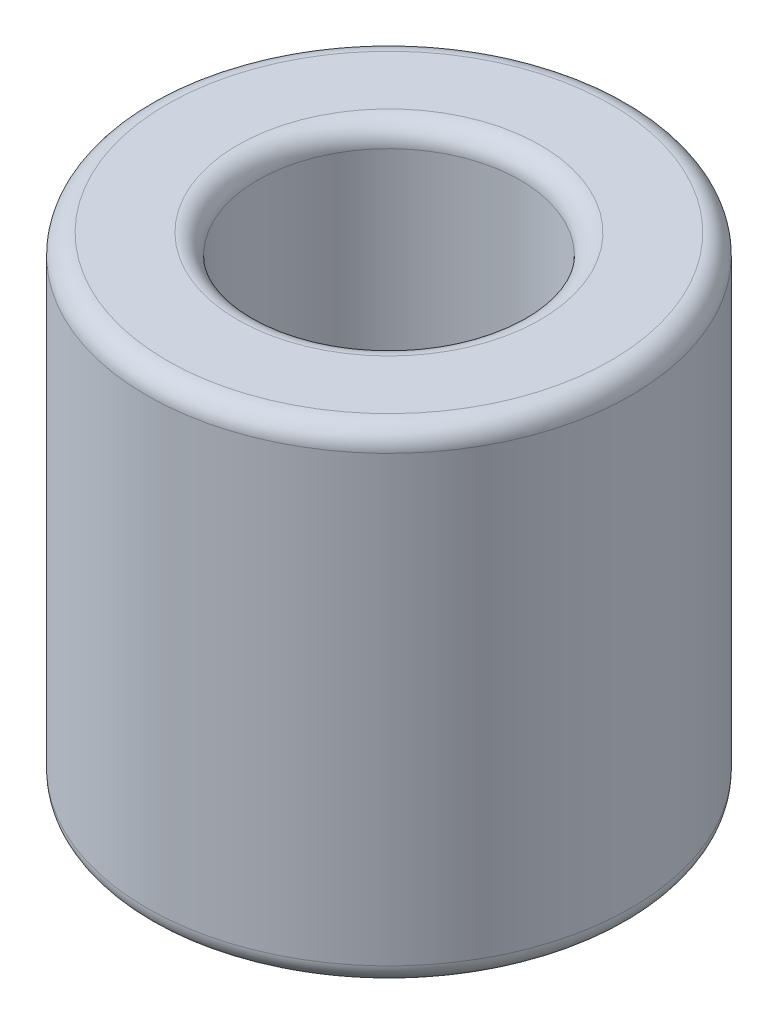
ISO-10303-21;
HEADER;
FILE_DESCRIPTION(('STEP AP214'),'2;1');
FILE_NAME('part.step','',(''),(''),'','','');
FILE_SCHEMA(('AUTOMOTIVE_DESIGN { 1 0 10303 214 1 1 1 1 }'));
ENDSEC;
DATA;
#1=APPLICATION_CONTEXT('core data for automotive mechanical design processes');
#2=APPLICATION_PROTOCOL_DEFINITION('international standard','automotive_design',2000,#1);
#3=PRODUCT_CONTEXT('',#1,'mechanical');
#4=PRODUCT('Part','Part','',(#3));
#5=PRODUCT_RELATED_PRODUCT_CATEGORY('part','',(#4));
#6=PRODUCT_DEFINITION_FORMATION('','',#4);
#7=PRODUCT_DEFINITION_CONTEXT('part definition',#1,'design');
#8=PRODUCT_DEFINITION('design','',#6,#7);
#9=PRODUCT_DEFINITION_SHAPE('','',#8);
#10=(LENGTH_UNIT() NAMED_UNIT(*) SI_UNIT(.MILLI.,.METRE.));
#11=(NAMED_UNIT(*) PLANE_ANGLE_UNIT() SI_UNIT($,.RADIAN.));
#12=(NAMED_UNIT(*) SI_UNIT($,.STERADIAN.) SOLID_ANGLE_UNIT());
#13=UNCERTAINTY_MEASURE_WITH_UNIT(LENGTH_MEASURE(1.E-05),#10,'distance_accuracy_value','');
#14=(GEOMETRIC_REPRESENTATION_CONTEXT(3) GLOBAL_UNCERTAINTY_ASSIGNED_CONTEXT((#13)) GLOBAL_UNIT_ASSIGNED_CONTEXT((#10,
#11,#12)) REPRESENTATION_CONTEXT('',''));
#15=CARTESIAN_POINT('',(0.,0.,0.));
#16=DIRECTION('',(0.,0.,1.));
#17=DIRECTION('',(1.,0.,0.));
#18=AXIS2_PLACEMENT_3D('',#15,#16,#17);
#19=CARTESIAN_POINT('',(0.,6.,0.));
#20=DIRECTION('',(0.,1.,0.));
#21=DIRECTION('',(0.,0.,1.));
#22=AXIS2_PLACEMENT_3D('',#19,#20,#21);
#23=PLANE('',#22);
#24=CARTESIAN_POINT('',(0.,6.,0.));
#25=DIRECTION('',(0.,1.,0.));
#26=DIRECTION('',(0.,0.,1.));
#27=AXIS2_PLACEMENT_3D('',#24,#25,#26);
#28=CIRCLE('',#27,1.875);
#29=CARTESIAN_POINT('',(0.,6.,1.875));
#30=VERTEX_POINT('',#29);
#31=EDGE_CURVE('E10',#30,#30,#28,.F.);
#32=ORIENTED_EDGE('',*,*,#31,.T.);
#33=EDGE_LOOP('',(#32));
#34=FACE_BOUND('',#33,.T.);
#35=CARTESIAN_POINT('',(0.,6.,0.));
#36=DIRECTION('',(0.,1.,0.));
#37=DIRECTION('',(0.,0.,1.));
#38=AXIS2_PLACEMENT_3D('',#35,#36,#37);
#39=CIRCLE('',#38,2.75);
#40=CARTESIAN_POINT('',(0.,6.,2.75));
#41=VERTEX_POINT('',#40);
#42=EDGE_CURVE('E41',#41,#41,#39,.T.);
#43=ORIENTED_EDGE('',*,*,#42,.T.);
#44=EDGE_LOOP('',(#43));
#45=FACE_BOUND('',#44,.T.);
#46=ADVANCED_FACE('F34',(#34,#45),#23,.T.);
#47=CARTESIAN_POINT('',(0.,0.,0.));
#48=DIRECTION('',(0.,1.,0.));
#49=DIRECTION('',(0.,0.,1.));
#50=AXIS2_PLACEMENT_3D('',#47,#48,#49);
#51=PLANE('',#50);
#52=CARTESIAN_POINT('',(0.,0.,0.));
#53=DIRECTION('',(0.,1.,0.));
#54=DIRECTION('',(0.,0.,1.));
#55=AXIS2_PLACEMENT_3D('',#52,#53,#54);
#56=CIRCLE('',#55,1.875);
#57=CARTESIAN_POINT('',(0.,0.,1.875));
#58=VERTEX_POINT('',#57);
#59=EDGE_CURVE('E60',#58,#58,#56,.T.);
#60=ORIENTED_EDGE('',*,*,#59,.T.);
#61=EDGE_LOOP('',(#60));
#62=FACE_BOUND('',#61,.T.);
#63=CARTESIAN_POINT('',(0.,0.,0.));
#64=DIRECTION('',(0.,1.,0.));
#65=DIRECTION('',(0.,0.,1.));
#66=AXIS2_PLACEMENT_3D('',#63,#64,#65);
#67=CIRCLE('',#66,2.75);
#68=CARTESIAN_POINT('',(0.,0.,2.75));
#69=VERTEX_POINT('',#68);
#70=EDGE_CURVE('E63',#69,#69,#67,.F.);
#71=ORIENTED_EDGE('',*,*,#70,.T.);
#72=EDGE_LOOP('',(#71));
#73=FACE_BOUND('',#72,.T.);
#74=ADVANCED_FACE('F67',(#62,#73),#51,.F.);
#75=CARTESIAN_POINT('',(0.,6.,0.));
#76=DIRECTION('',(0.,-1.,0.));
#77=DIRECTION('',(0.,0.,-1.));
#78=AXIS2_PLACEMENT_3D('',#75,#76,#77);
#79=CYLINDRICAL_SURFACE('',#78,3.);
#80=CARTESIAN_POINT('',(0.,0.25,0.));
#81=DIRECTION('',(0.,1.,0.));
#82=DIRECTION('',(0.,0.,1.));
#83=AXIS2_PLACEMENT_3D('',#80,#81,#82);
#84=CIRCLE('',#83,3.);
#85=CARTESIAN_POINT('',(0.,0.25,3.));
#86=VERTEX_POINT('',#85);
#87=EDGE_CURVE('E45',#86,#86,#84,.T.);
#88=ORIENTED_EDGE('',*,*,#87,.T.);
#89=EDGE_LOOP('',(#88));
#90=FACE_BOUND('',#89,.T.);
#91=CARTESIAN_POINT('',(0.,5.75,0.));
#92=DIRECTION('',(0.,1.,0.));
#93=DIRECTION('',(0.,0.,1.));
#94=AXIS2_PLACEMENT_3D('',#91,#92,#93);
#95=CIRCLE('',#94,3.);
#96=CARTESIAN_POINT('',(0.,5.75,3.));
#97=VERTEX_POINT('',#96);
#98=EDGE_CURVE('E49',#97,#97,#95,.F.);
#99=ORIENTED_EDGE('',*,*,#98,.T.);
#100=EDGE_LOOP('',(#99));
#101=FACE_BOUND('',#100,.T.);
#102=ADVANCED_FACE('F77',(#90,#101),#79,.T.);
#103=CARTESIAN_POINT('',(0.,6.,0.));
#104=DIRECTION('',(0.,-1.,0.));
#105=DIRECTION('',(0.,0.,-1.));
#106=AXIS2_PLACEMENT_3D('',#103,#104,#105);
#107=CYLINDRICAL_SURFACE('',#106,1.625);
#108=CARTESIAN_POINT('',(0.,0.25,0.));
#109=DIRECTION('',(0.,1.,0.));
#110=DIRECTION('',(0.,0.,1.));
#111=AXIS2_PLACEMENT_3D('',#108,#109,#110);
#112=CIRCLE('',#111,1.625);
#113=CARTESIAN_POINT('',(0.,0.25,1.625));
#114=VERTEX_POINT('',#113);
#115=EDGE_CURVE('E54',#114,#114,#112,.F.);
#116=ORIENTED_EDGE('',*,*,#115,.T.);
#117=EDGE_LOOP('',(#116));
#118=FACE_BOUND('',#117,.T.);
#119=CARTESIAN_POINT('',(0.,5.75,0.));
#120=DIRECTION('',(0.,1.,0.));
#121=DIRECTION('',(0.,0.,1.));
#122=AXIS2_PLACEMENT_3D('',#119,#120,#121);
#123=CIRCLE('',#122,1.625);
#124=CARTESIAN_POINT('',(0.,5.75,1.625));
#125=VERTEX_POINT('',#124);
#126=EDGE_CURVE('E57',#125,#125,#123,.T.);
#127=ORIENTED_EDGE('',*,*,#126,.T.);
#128=EDGE_LOOP('',(#127));
#129=FACE_BOUND('',#128,.T.);
#130=ADVANCED_FACE('F80',(#118,#129),#107,.F.);
#131=CARTESIAN_POINT('',(0.,0.25,0.));
#132=DIRECTION('',(0.,1.,0.));
#133=DIRECTION('',(0.,0.,1.));
#134=AXIS2_PLACEMENT_3D('',#131,#132,#133);
#135=TOROIDAL_SURFACE('',#134,1.875,0.25);
#136=ORIENTED_EDGE('',*,*,#115,.F.);
#137=EDGE_LOOP('',(#136));
#138=FACE_BOUND('',#137,.T.);
#139=ORIENTED_EDGE('',*,*,#59,.F.);
#140=EDGE_LOOP('',(#139));
#141=FACE_BOUND('',#140,.T.);
#142=ADVANCED_FACE('F73',(#138,#141),#135,.T.);
#143=CARTESIAN_POINT('',(0.,0.25,0.));
#144=DIRECTION('',(0.,1.,0.));
#145=DIRECTION('',(0.,0.,1.));
#146=AXIS2_PLACEMENT_3D('',#143,#144,#145);
#147=TOROIDAL_SURFACE('',#146,2.75,0.25);
#148=ORIENTED_EDGE('',*,*,#70,.F.);
#149=EDGE_LOOP('',(#148));
#150=FACE_BOUND('',#149,.T.);
#151=ORIENTED_EDGE('',*,*,#87,.F.);
#152=EDGE_LOOP('',(#151));
#153=FACE_BOUND('',#152,.T.);
#154=ADVANCED_FACE('F69',(#150,#153),#147,.T.);
#155=CARTESIAN_POINT('',(0.,5.75,0.));
#156=DIRECTION('',(0.,1.,0.));
#157=DIRECTION('',(0.,0.,1.));
#158=AXIS2_PLACEMENT_3D('',#155,#156,#157);
#159=TOROIDAL_SURFACE('',#158,1.875,0.25);
#160=ORIENTED_EDGE('',*,*,#31,.F.);
#161=EDGE_LOOP('',(#160));
#162=FACE_BOUND('',#161,.T.);
#163=ORIENTED_EDGE('',*,*,#126,.F.);
#164=EDGE_LOOP('',(#163));
#165=FACE_BOUND('',#164,.T.);
#166=ADVANCED_FACE('F72',(#162,#165),#159,.T.);
#167=CARTESIAN_POINT('',(0.,5.75,0.));
#168=DIRECTION('',(0.,1.,0.));
#169=DIRECTION('',(0.,0.,1.));
#170=AXIS2_PLACEMENT_3D('',#167,#168,#169);
#171=TOROIDAL_SURFACE('',#170,2.75,0.25);
#172=ORIENTED_EDGE('',*,*,#98,.F.);
#173=EDGE_LOOP('',(#172));
#174=FACE_BOUND('',#173,.T.);
#175=ORIENTED_EDGE('',*,*,#42,.F.);
#176=EDGE_LOOP('',(#175));
#177=FACE_BOUND('',#176,.T.);
#178=ADVANCED_FACE('F36',(#174,#177),#171,.T.);
#179=CLOSED_SHELL('',(#46,#74,#102,#130,#142,#154,#166,#178));
#180=MANIFOLD_SOLID_BREP('B2',#179);
#181=ADVANCED_BREP_SHAPE_REPRESENTATION('',(#18,#180),#14);
#182=SHAPE_DEFINITION_REPRESENTATION(#9,#181);
ENDSEC;
END-ISO-10303-21;
